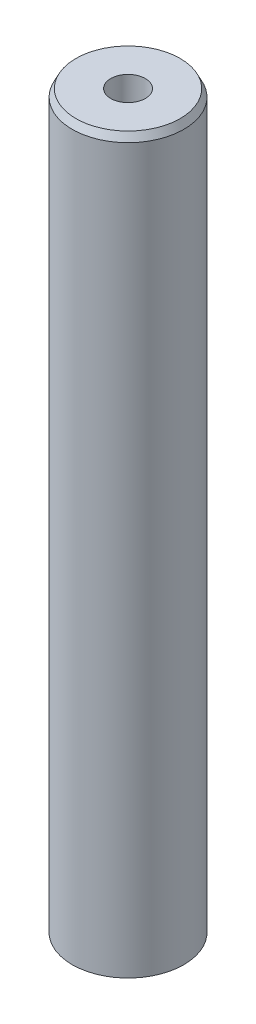
ISO-10303-21;
HEADER;
FILE_DESCRIPTION(('STEP AP214'),'2;1');
FILE_NAME('part.step','',(''),(''),'','','');
FILE_SCHEMA(('AUTOMOTIVE_DESIGN { 1 0 10303 214 1 1 1 1 }'));
ENDSEC;
DATA;
#1=APPLICATION_CONTEXT('core data for automotive mechanical design processes');
#2=APPLICATION_PROTOCOL_DEFINITION('international standard','automotive_design',2000,#1);
#3=PRODUCT_CONTEXT('',#1,'mechanical');
#4=PRODUCT('Part','Part','',(#3));
#5=PRODUCT_RELATED_PRODUCT_CATEGORY('part','',(#4));
#6=PRODUCT_DEFINITION_FORMATION('','',#4);
#7=PRODUCT_DEFINITION_CONTEXT('part definition',#1,'design');
#8=PRODUCT_DEFINITION('design','',#6,#7);
#9=PRODUCT_DEFINITION_SHAPE('','',#8);
#10=(LENGTH_UNIT() NAMED_UNIT(*) SI_UNIT(.MILLI.,.METRE.));
#11=(NAMED_UNIT(*) PLANE_ANGLE_UNIT() SI_UNIT($,.RADIAN.));
#12=(NAMED_UNIT(*) SI_UNIT($,.STERADIAN.) SOLID_ANGLE_UNIT());
#13=UNCERTAINTY_MEASURE_WITH_UNIT(LENGTH_MEASURE(1.E-05),#10,'distance_accuracy_value','');
#14=(GEOMETRIC_REPRESENTATION_CONTEXT(3) GLOBAL_UNCERTAINTY_ASSIGNED_CONTEXT((#13)) GLOBAL_UNIT_ASSIGNED_CONTEXT((#10,
#11,#12)) REPRESENTATION_CONTEXT('',''));
#15=CARTESIAN_POINT('',(0.,0.,0.));
#16=DIRECTION('',(0.,0.,1.));
#17=DIRECTION('',(1.,0.,0.));
#18=AXIS2_PLACEMENT_3D('',#15,#16,#17);
#19=CARTESIAN_POINT('',(0.,65.7821925693221,0.));
#20=DIRECTION('',(0.,-1.,0.));
#21=DIRECTION('',(0.,0.,-1.));
#22=AXIS2_PLACEMENT_3D('',#19,#20,#21);
#23=CYLINDRICAL_SURFACE('',#22,5.);
#24=CARTESIAN_POINT('',(0.,65.1147867300304,0.));
#25=DIRECTION('',(0.,1.,0.));
#26=DIRECTION('',(0.,0.,1.));
#27=AXIS2_PLACEMENT_3D('',#24,#25,#26);
#28=CIRCLE('',#27,5.);
#29=CARTESIAN_POINT('',(0.,65.1147867300304,-5.));
#30=VERTEX_POINT('',#29);
#31=EDGE_CURVE('E50',#30,#30,#28,.F.);
#32=ORIENTED_EDGE('',*,*,#31,.T.);
#33=EDGE_LOOP('',(#32));
#34=FACE_BOUND('',#33,.T.);
#35=CARTESIAN_POINT('',(0.,0.332589930945912,0.));
#36=DIRECTION('',(0.,1.,0.));
#37=DIRECTION('',(0.,0.,1.));
#38=AXIS2_PLACEMENT_3D('',#35,#36,#37);
#39=CIRCLE('',#38,5.);
#40=CARTESIAN_POINT('',(0.,0.332589930945912,5.));
#41=VERTEX_POINT('',#40);
#42=EDGE_CURVE('E51',#41,#41,#39,.T.);
#43=ORIENTED_EDGE('',*,*,#42,.T.);
#44=EDGE_LOOP('',(#43));
#45=FACE_BOUND('',#44,.T.);
#46=ADVANCED_FACE('F39',(#34,#45),#23,.T.);
#47=CARTESIAN_POINT('',(0.,65.7821925693221,0.));
#48=DIRECTION('',(0.,1.,0.));
#49=DIRECTION('',(0.,0.,1.));
#50=AXIS2_PLACEMENT_3D('',#47,#48,#49);
#51=PLANE('',#50);
#52=CARTESIAN_POINT('',(0.,65.7821925693221,0.));
#53=DIRECTION('',(0.,1.,0.));
#54=DIRECTION('',(0.,0.,1.));
#55=AXIS2_PLACEMENT_3D('',#52,#53,#54);
#56=CIRCLE('',#55,4.6674100690541);
#57=CARTESIAN_POINT('',(0.,65.7821925693221,-4.66741006905411));
#58=VERTEX_POINT('',#57);
#59=EDGE_CURVE('E54',#58,#58,#56,.T.);
#60=ORIENTED_EDGE('',*,*,#59,.T.);
#61=EDGE_LOOP('',(#60));
#62=FACE_BOUND('',#61,.T.);
#63=CARTESIAN_POINT('',(0.,65.7821925693221,0.));
#64=DIRECTION('',(0.,1.,0.));
#65=DIRECTION('',(0.,0.,1.));
#66=AXIS2_PLACEMENT_3D('',#63,#64,#65);
#67=CIRCLE('',#66,1.54961374399989);
#68=CARTESIAN_POINT('',(0.,65.7821925693221,1.54961374399989));
#69=VERTEX_POINT('',#68);
#70=EDGE_CURVE('E58',#69,#69,#67,.T.);
#71=ORIENTED_EDGE('',*,*,#70,.F.);
#72=EDGE_LOOP('',(#71));
#73=FACE_BOUND('',#72,.T.);
#74=ADVANCED_FACE('F69',(#62,#73),#51,.T.);
#75=CARTESIAN_POINT('',(0.,0.,0.));
#76=DIRECTION('',(0.,1.,0.));
#77=DIRECTION('',(0.,0.,1.));
#78=AXIS2_PLACEMENT_3D('',#75,#76,#77);
#79=PLANE('',#78);
#80=CARTESIAN_POINT('',(0.,0.,0.));
#81=DIRECTION('',(0.,1.,0.));
#82=DIRECTION('',(0.,0.,1.));
#83=AXIS2_PLACEMENT_3D('',#80,#81,#82);
#84=CIRCLE('',#83,4.33259416070833);
#85=CARTESIAN_POINT('',(0.,0.,4.33259416070833));
#86=VERTEX_POINT('',#85);
#87=EDGE_CURVE('E10',#86,#86,#84,.F.);
#88=ORIENTED_EDGE('',*,*,#87,.T.);
#89=EDGE_LOOP('',(#88));
#90=FACE_BOUND('',#89,.T.);
#91=CARTESIAN_POINT('',(0.,0.,0.));
#92=DIRECTION('',(0.,1.,0.));
#93=DIRECTION('',(0.,0.,1.));
#94=AXIS2_PLACEMENT_3D('',#91,#92,#93);
#95=CIRCLE('',#94,1.54961374399989);
#96=CARTESIAN_POINT('',(0.,0.,1.54961374399989));
#97=VERTEX_POINT('',#96);
#98=EDGE_CURVE('E63',#97,#97,#95,.T.);
#99=ORIENTED_EDGE('',*,*,#98,.T.);
#100=EDGE_LOOP('',(#99));
#101=FACE_BOUND('',#100,.T.);
#102=ADVANCED_FACE('F75',(#90,#101),#79,.F.);
#103=CARTESIAN_POINT('',(0.,65.7821925693221,0.));
#104=DIRECTION('',(0.,-1.,0.));
#105=DIRECTION('',(0.,0.,-1.));
#106=AXIS2_PLACEMENT_3D('',#103,#104,#105);
#107=CYLINDRICAL_SURFACE('',#106,1.54961374399989);
#108=ORIENTED_EDGE('',*,*,#70,.T.);
#109=EDGE_LOOP('',(#108));
#110=FACE_BOUND('',#109,.T.);
#111=ORIENTED_EDGE('',*,*,#98,.F.);
#112=EDGE_LOOP('',(#111));
#113=FACE_BOUND('',#112,.T.);
#114=ADVANCED_FACE('F70',(#110,#113),#107,.F.);
#115=CARTESIAN_POINT('',(0.,65.7821925693221,0.));
#116=DIRECTION('',(0.,-1.,0.));
#117=DIRECTION('',(0.,0.,-1.));
#118=AXIS2_PLACEMENT_3D('',#115,#116,#117);
#119=CONICAL_SURFACE('',#118,4.6674100690541,0.462312612042222);
#120=CARTESIAN_POINT('',(0.,65.1147867300304,-5.));
#121=CARTESIAN_POINT('',(0.,65.1217388741897,-4.99653552155265));
#122=CARTESIAN_POINT('',(0.,65.128691018349,-4.9930710431053));
#123=CARTESIAN_POINT('',(0.,65.1425953066676,-4.98614208621059));
#124=CARTESIAN_POINT('',(0.,65.1495474508269,-4.98267760776324));
#125=CARTESIAN_POINT('',(0.,65.1634517391454,-4.97574865086853));
#126=CARTESIAN_POINT('',(0.,65.1704038833047,-4.97228417242118));
#127=CARTESIAN_POINT('',(0.,65.1843081716233,-4.96535521552647));
#128=CARTESIAN_POINT('',(0.,65.1912603157826,-4.96189073707912));
#129=CARTESIAN_POINT('',(0.,65.2051646041012,-4.95496178018441));
#130=CARTESIAN_POINT('',(0.,65.2121167482605,-4.95149730173706));
#131=CARTESIAN_POINT('',(0.,65.226021036579,-4.94456834484235));
#132=CARTESIAN_POINT('',(0.,65.2329731807383,-4.941103866395));
#133=CARTESIAN_POINT('',(0.,65.2468774690569,-4.9341749095003));
#134=CARTESIAN_POINT('',(0.,65.2538296132162,-4.93071043105294));
#135=CARTESIAN_POINT('',(0.,65.2677339015348,-4.92378147415823));
#136=CARTESIAN_POINT('',(0.,65.2746860456941,-4.92031699571088));
#137=CARTESIAN_POINT('',(0.,65.2885903340126,-4.91338803881618));
#138=CARTESIAN_POINT('',(0.,65.2955424781719,-4.90992356036882));
#139=CARTESIAN_POINT('',(0.,65.3094467664905,-4.90299460347412));
#140=CARTESIAN_POINT('',(0.,65.3163989106498,-4.89953012502676));
#141=CARTESIAN_POINT('',(0.,65.3303031989684,-4.89260116813206));
#142=CARTESIAN_POINT('',(0.,65.3372553431277,-4.8891366896847));
#143=CARTESIAN_POINT('',(0.,65.3511596314462,-4.88220773279));
#144=CARTESIAN_POINT('',(0.,65.3581117756055,-4.87874325434265));
#145=CARTESIAN_POINT('',(0.,65.3720160639241,-4.87181429744794));
#146=CARTESIAN_POINT('',(0.,65.3789682080834,-4.86834981900058));
#147=CARTESIAN_POINT('',(0.,65.3928724964019,-4.86142086210588));
#148=CARTESIAN_POINT('',(0.,65.3998246405612,-4.85795638365853));
#149=CARTESIAN_POINT('',(0.,65.4137289288798,-4.85102742676382));
#150=CARTESIAN_POINT('',(0.,65.4206810730391,-4.84756294831647));
#151=CARTESIAN_POINT('',(0.,65.4345853613577,-4.84063399142176));
#152=CARTESIAN_POINT('',(0.,65.441537505517,-4.83716951297441));
#153=CARTESIAN_POINT('',(0.,65.4554417938356,-4.8302405560797));
#154=CARTESIAN_POINT('',(0.,65.4623939379948,-4.82677607763235));
#155=CARTESIAN_POINT('',(0.,65.4762982263134,-4.81984712073764));
#156=CARTESIAN_POINT('',(0.,65.4832503704727,-4.81638264229029));
#157=CARTESIAN_POINT('',(0.,65.4971546587913,-4.80945368539558));
#158=CARTESIAN_POINT('',(0.,65.5041068029506,-4.80598920694823));
#159=CARTESIAN_POINT('',(0.,65.5180110912691,-4.79906025005353));
#160=CARTESIAN_POINT('',(0.,65.5249632354284,-4.79559577160617));
#161=CARTESIAN_POINT('',(0.,65.538867523747,-4.78866681471146));
#162=CARTESIAN_POINT('',(0.,65.5458196679063,-4.78520233626411));
#163=CARTESIAN_POINT('',(0.,65.5597239562249,-4.77827337936941));
#164=CARTESIAN_POINT('',(0.,65.5666761003842,-4.77480890092205));
#165=CARTESIAN_POINT('',(0.,65.5805803887027,-4.76787994402735));
#166=CARTESIAN_POINT('',(0.,65.587532532862,-4.76441546557999));
#167=CARTESIAN_POINT('',(0.,65.6014368211806,-4.75748650868529));
#168=CARTESIAN_POINT('',(0.,65.6083889653399,-4.75402203023793));
#169=CARTESIAN_POINT('',(0.,65.6222932536585,-4.74709307334323));
#170=CARTESIAN_POINT('',(0.,65.6292453978178,-4.74362859489587));
#171=CARTESIAN_POINT('',(0.,65.6431496861363,-4.73669963800117));
#172=CARTESIAN_POINT('',(0.,65.6501018302956,-4.73323515955381));
#173=CARTESIAN_POINT('',(0.,65.6640061186142,-4.72630620265911));
#174=CARTESIAN_POINT('',(0.,65.6709582627735,-4.72284172421176));
#175=CARTESIAN_POINT('',(0.,65.6848625510921,-4.71591276731705));
#176=CARTESIAN_POINT('',(0.,65.6918146952513,-4.7124482888697));
#177=CARTESIAN_POINT('',(0.,65.7057189835699,-4.70551933197499));
#178=CARTESIAN_POINT('',(0.,65.7126711277292,-4.70205485352764));
#179=CARTESIAN_POINT('',(0.,65.7265754160478,-4.69512589663293));
#180=CARTESIAN_POINT('',(0.,65.7335275602071,-4.69166141818558));
#181=CARTESIAN_POINT('',(0.,65.7474318485257,-4.68473246129087));
#182=CARTESIAN_POINT('',(0.,65.7543839926849,-4.68126798284352));
#183=CARTESIAN_POINT('',(0.,65.7682882810035,-4.67433902594881));
#184=CARTESIAN_POINT('',(0.,65.7752404251628,-4.67087454750146));
#185=CARTESIAN_POINT('',(0.,65.7821925693221,-4.66741006905411));
#186=B_SPLINE_CURVE_WITH_KNOTS('',3,(#120,#121,#122,#123,#124,#125,#126,#127,#128,#129,#130,
#131,#132,#133,#134,#135,#136,#137,#138,#139,#140,#141,#142,#143,#144,#145,#146,#147,#148,#149,
#150,#151,#152,#153,#154,#155,#156,#157,#158,#159,#160,#161,#162,#163,#164,#165,#166,#167,#168,
#169,#170,#171,#172,#173,#174,#175,#176,#177,#178,#179,#180,#181,#182,#183,#184,#185),
.UNSPECIFIED.,.F.,.F.,(4,2,2,2,2,2,2,2,2,2,2,2,2,2,2,2,2,2,2,2,2,2,2,2,2,2,2,2,2,2,2,2,4),(0.,
0.0233026666695691,0.0466053333391383,0.0699080000087198,0.093210666678289,0.116513333347858,
0.13981600001744,0.163118666687009,0.18642133335659,0.209724000026159,0.233026666695729,
0.25632933336531,0.279632000034879,0.302934666704448,0.32623733337403,0.349540000043599,
0.37284266671318,0.396145333382749,0.419448000052319,0.4427506667219,0.466053333391469,
0.489356000061038,0.51265866673062,0.535961333400189,0.559264000069771,0.58256666673934,
0.605869333408909,0.62917200007849,0.65247466674806,0.675777333417629,0.69908000008721,
0.722382666756779,0.745685333426361),.UNSPECIFIED.);
#187=EDGE_CURVE('BSEAM81',#30,#58,#186,.T.);
#188=ORIENTED_EDGE('',*,*,#31,.F.);
#189=ORIENTED_EDGE('',*,*,#59,.F.);
#190=ORIENTED_EDGE('',*,*,#187,.T.);
#191=ORIENTED_EDGE('',*,*,#187,.F.);
#192=EDGE_LOOP('',(#188,#190,#189,#191));
#193=FACE_BOUND('',#192,.T.);
#194=ADVANCED_FACE('F81',(#193),#119,.T.);
#195=CARTESIAN_POINT('',(0.,0.332589930945912,0.));
#196=DIRECTION('',(0.,1.,0.));
#197=DIRECTION('',(0.,0.,1.));
#198=AXIS2_PLACEMENT_3D('',#195,#196,#197);
#199=CONICAL_SURFACE('',#198,5.,1.10848371475267);
#200=ORIENTED_EDGE('',*,*,#87,.F.);
#201=EDGE_LOOP('',(#200));
#202=FACE_BOUND('',#201,.T.);
#203=ORIENTED_EDGE('',*,*,#42,.F.);
#204=EDGE_LOOP('',(#203));
#205=FACE_BOUND('',#204,.T.);
#206=ADVANCED_FACE('F45',(#202,#205),#199,.T.);
#207=CLOSED_SHELL('',(#46,#74,#102,#114,#194,#206));
#208=MANIFOLD_SOLID_BREP('B2',#207);
#209=ADVANCED_BREP_SHAPE_REPRESENTATION('',(#18,#208),#14);
#210=SHAPE_DEFINITION_REPRESENTATION(#9,#209);
ENDSEC;
END-ISO-10303-21;
